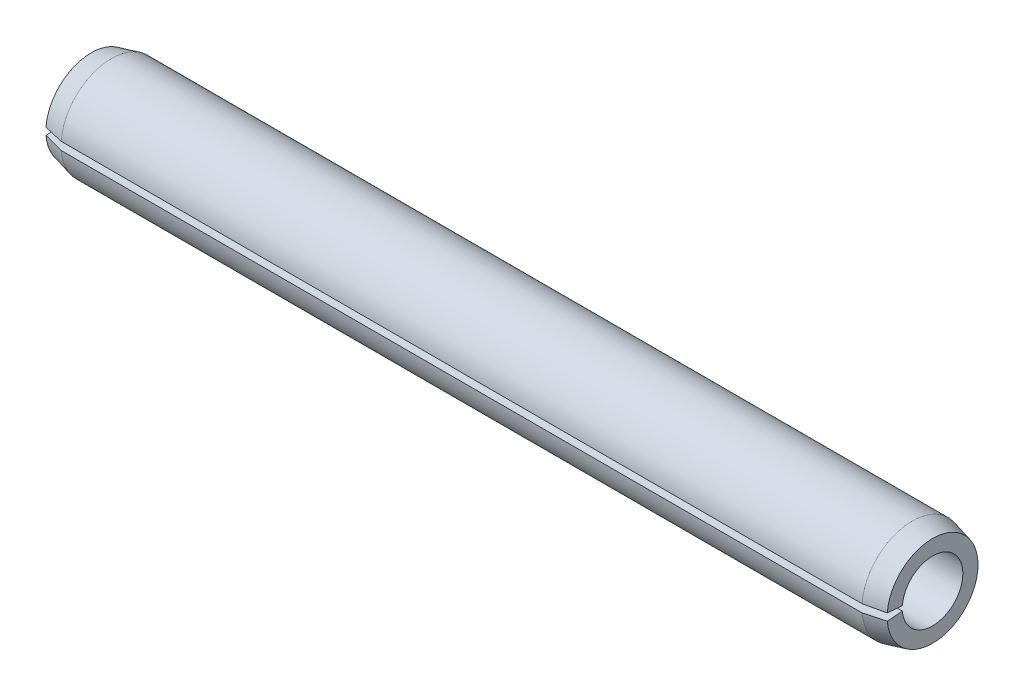
ISO-10303-21;
HEADER;
FILE_DESCRIPTION(('STEP AP214'),'2;1');
FILE_NAME('part.step','',(''),(''),'','','');
FILE_SCHEMA(('AUTOMOTIVE_DESIGN { 1 0 10303 214 1 1 1 1 }'));
ENDSEC;
DATA;
#1=APPLICATION_CONTEXT('core data for automotive mechanical design processes');
#2=APPLICATION_PROTOCOL_DEFINITION('international standard','automotive_design',2000,#1);
#3=PRODUCT_CONTEXT('',#1,'mechanical');
#4=PRODUCT('Part','Part','',(#3));
#5=PRODUCT_RELATED_PRODUCT_CATEGORY('part','',(#4));
#6=PRODUCT_DEFINITION_FORMATION('','',#4);
#7=PRODUCT_DEFINITION_CONTEXT('part definition',#1,'design');
#8=PRODUCT_DEFINITION('design','',#6,#7);
#9=PRODUCT_DEFINITION_SHAPE('','',#8);
#10=(LENGTH_UNIT() NAMED_UNIT(*) SI_UNIT(.MILLI.,.METRE.));
#11=(NAMED_UNIT(*) PLANE_ANGLE_UNIT() SI_UNIT($,.RADIAN.));
#12=(NAMED_UNIT(*) SI_UNIT($,.STERADIAN.) SOLID_ANGLE_UNIT());
#13=UNCERTAINTY_MEASURE_WITH_UNIT(LENGTH_MEASURE(1.E-05),#10,'distance_accuracy_value','');
#14=(GEOMETRIC_REPRESENTATION_CONTEXT(3) GLOBAL_UNCERTAINTY_ASSIGNED_CONTEXT((#13)) GLOBAL_UNIT_ASSIGNED_CONTEXT((#10,
#11,#12)) REPRESENTATION_CONTEXT('',''));
#15=CARTESIAN_POINT('',(0.,0.,0.));
#16=DIRECTION('',(0.,0.,1.));
#17=DIRECTION('',(1.,0.,0.));
#18=AXIS2_PLACEMENT_3D('',#15,#16,#17);
#19=CARTESIAN_POINT('',(50.,-2.7324,-2.732350061));
#20=DIRECTION('',(-1.,0.,0.));
#21=DIRECTION('',(0.,0.,1.));
#22=AXIS2_PLACEMENT_3D('',#19,#20,#21);
#23=PLANE('',#22);
#24=CARTESIAN_POINT('',(50.,0.,0.));
#25=DIRECTION('',(-1.,0.,0.));
#26=DIRECTION('',(0.,0.,1.));
#27=AXIS2_PLACEMENT_3D('',#24,#25,#26);
#28=CIRCLE('',#27,1.8);
#29=CARTESIAN_POINT('',(50.,-0.141226372001351,1.79445120074393));
#30=VERTEX_POINT('',#29);
#31=CARTESIAN_POINT('',(50.,0.141226371840222,1.79445120075661));
#32=VERTEX_POINT('',#31);
#33=EDGE_CURVE('E81',#30,#32,#28,.F.);
#34=ORIENTED_EDGE('',*,*,#33,.F.);
#35=DIRECTION('',(0.,-0.0784590958639548,0.996917333722416));
#36=VECTOR('',#35,1.);
#37=CARTESIAN_POINT('',(50.,-0.1883018295,2.392601601));
#38=LINE('',#37,#36);
#39=CARTESIAN_POINT('',(50.,-0.211839558145811,2.69167680110457));
#40=VERTEX_POINT('',#39);
#41=EDGE_CURVE('E102',#30,#40,#38,.T.);
#42=ORIENTED_EDGE('',*,*,#41,.T.);
#43=CARTESIAN_POINT('',(50.,0.,0.));
#44=DIRECTION('',(-1.,0.,0.));
#45=DIRECTION('',(0.,0.,1.));
#46=AXIS2_PLACEMENT_3D('',#43,#44,#45);
#47=CIRCLE('',#46,2.69999999999999);
#48=CARTESIAN_POINT('',(50.,0.211839558253768,2.69167680104788));
#49=VERTEX_POINT('',#48);
#50=EDGE_CURVE('E106',#40,#49,#47,.F.);
#51=ORIENTED_EDGE('',*,*,#50,.T.);
#52=DIRECTION('',(0.,0.0784590958639548,0.996917333722416));
#53=VECTOR('',#52,1.);
#54=CARTESIAN_POINT('',(50.,0.1883018295,2.392601601));
#55=LINE('',#54,#53);
#56=EDGE_CURVE('E104',#32,#49,#55,.T.);
#57=ORIENTED_EDGE('',*,*,#56,.F.);
#58=EDGE_LOOP('',(#34,#42,#51,#57));
#59=FACE_BOUND('',#58,.T.);
#60=ADVANCED_FACE('F17',(#59),#23,.F.);
#61=CARTESIAN_POINT('',(0.,-0.235377287,2.990752001));
#62=DIRECTION('',(0.,-0.996917333722416,-0.0784590958639548));
#63=DIRECTION('',(0.,0.0784590958639548,-0.996917333722416));
#64=AXIS2_PLACEMENT_3D('',#61,#62,#63);
#65=PLANE('',#64);
#66=DIRECTION('',(0.970142500145332,-0.0190291258060693,0.241787968647783));
#67=VECTOR('',#66,1.);
#68=CARTESIAN_POINT('',(0.,-0.211839558286294,2.69167680109352));
#69=LINE('',#68,#67);
#70=CARTESIAN_POINT('',(1.19999999999998,-0.235377286844655,2.99075200122605));
#71=VERTEX_POINT('',#70);
#72=CARTESIAN_POINT('',(0.,-0.211839558271916,2.69167680109466));
#73=VERTEX_POINT('',#72);
#74=EDGE_CURVE('E21',#71,#73,#69,.F.);
#75=ORIENTED_EDGE('',*,*,#74,.F.);
#76=DIRECTION('',(-1.,0.,0.));
#77=VECTOR('',#76,1.);
#78=CARTESIAN_POINT('',(25.,-0.235377286704538,2.99075200123708));
#79=LINE('',#78,#77);
#80=CARTESIAN_POINT('',(48.8000000000251,-0.235377286704047,2.99075200123083));
#81=VERTEX_POINT('',#80);
#82=EDGE_CURVE('E72',#71,#81,#79,.F.);
#83=ORIENTED_EDGE('',*,*,#82,.T.);
#84=DIRECTION('',(-0.970142500145332,-0.0190291257834137,0.241787968649565));
#85=VECTOR('',#84,1.);
#86=CARTESIAN_POINT('',(49.4,-0.223608422369311,2.84121440117523));
#87=LINE('',#86,#85);
#88=EDGE_CURVE('E101',#81,#40,#87,.F.);
#89=ORIENTED_EDGE('',*,*,#88,.T.);
#90=ORIENTED_EDGE('',*,*,#41,.F.);
#91=DIRECTION('',(-1.,0.,0.));
#92=VECTOR('',#91,1.);
#93=CARTESIAN_POINT('',(25.,-0.141226372022723,1.79445120074225));
#94=LINE('',#93,#92);
#95=CARTESIAN_POINT('',(0.,-0.141226372001351,1.79445120074393));
#96=VERTEX_POINT('',#95);
#97=EDGE_CURVE('E118',#96,#30,#94,.F.);
#98=ORIENTED_EDGE('',*,*,#97,.F.);
#99=DIRECTION('',(0.,0.0784590958639548,-0.996917333722416));
#100=VECTOR('',#99,1.);
#101=CARTESIAN_POINT('',(0.,-0.1883018295,2.392601601));
#102=LINE('',#101,#100);
#103=EDGE_CURVE('E99',#73,#96,#102,.T.);
#104=ORIENTED_EDGE('',*,*,#103,.F.);
#105=EDGE_LOOP('',(#75,#83,#89,#90,#98,#104));
#106=FACE_BOUND('',#105,.T.);
#107=ADVANCED_FACE('F138',(#106),#65,.F.);
#108=CARTESIAN_POINT('',(50.,0.,0.));
#109=DIRECTION('',(-1.,0.,0.));
#110=DIRECTION('',(0.,0.,1.));
#111=AXIS2_PLACEMENT_3D('',#108,#109,#110);
#112=CONICAL_SURFACE('',#111,2.7,0.244978663126863);
#113=ORIENTED_EDGE('',*,*,#50,.F.);
#114=ORIENTED_EDGE('',*,*,#88,.F.);
#115=CARTESIAN_POINT('',(48.8,0.,0.));
#116=DIRECTION('',(-1.,0.,0.));
#117=DIRECTION('',(0.,0.,1.));
#118=AXIS2_PLACEMENT_3D('',#115,#116,#117);
#119=CIRCLE('',#118,3.);
#120=CARTESIAN_POINT('',(48.7999999995736,0.235377286796042,2.99075200112297));
#121=VERTEX_POINT('',#120);
#122=EDGE_CURVE('E88',#81,#121,#119,.F.);
#123=ORIENTED_EDGE('',*,*,#122,.T.);
#124=DIRECTION('',(-0.970142500167604,0.0190291258481599,0.241787968555105));
#125=VECTOR('',#124,1.);
#126=CARTESIAN_POINT('',(50.,0.21183955825,2.691676801));
#127=LINE('',#126,#125);
#128=EDGE_CURVE('E87',#49,#121,#127,.T.);
#129=ORIENTED_EDGE('',*,*,#128,.F.);
#130=EDGE_LOOP('',(#113,#114,#123,#129));
#131=FACE_BOUND('',#130,.T.);
#132=ADVANCED_FACE('F125',(#131),#112,.T.);
#133=CARTESIAN_POINT('',(0.,0.235377287,2.990752001));
#134=DIRECTION('',(0.,-0.996917333722416,0.0784590958639548));
#135=DIRECTION('',(0.,-0.0784590958639548,-0.996917333722416));
#136=AXIS2_PLACEMENT_3D('',#133,#134,#135);
#137=PLANE('',#136);
#138=DIRECTION('',(0.970142500145332,0.0190291258825971,0.24178796864176));
#139=VECTOR('',#138,1.);
#140=CARTESIAN_POINT('',(0.6,0.2236084235348,2.8412144010835));
#141=LINE('',#140,#139);
#142=CARTESIAN_POINT('',(1.19999999999999,0.235377287596547,2.99075200116688));
#143=VERTEX_POINT('',#142);
#144=CARTESIAN_POINT('',(0.,0.211839558697885,2.69167680106113));
#145=VERTEX_POINT('',#144);
#146=EDGE_CURVE('E77',#143,#145,#141,.F.);
#147=ORIENTED_EDGE('',*,*,#146,.T.);
#148=DIRECTION('',(0.,-0.0784590958639548,-0.996917333722416));
#149=VECTOR('',#148,1.);
#150=CARTESIAN_POINT('',(0.,0.1883018295,2.392601601));
#151=LINE('',#150,#149);
#152=CARTESIAN_POINT('',(0.,0.141226371840222,1.79445120075661));
#153=VERTEX_POINT('',#152);
#154=EDGE_CURVE('E95',#145,#153,#151,.T.);
#155=ORIENTED_EDGE('',*,*,#154,.T.);
#156=DIRECTION('',(1.,0.,0.));
#157=VECTOR('',#156,1.);
#158=CARTESIAN_POINT('',(25.,0.141226371700465,1.79445120076761));
#159=LINE('',#158,#157);
#160=EDGE_CURVE('E127',#32,#153,#159,.F.);
#161=ORIENTED_EDGE('',*,*,#160,.F.);
#162=ORIENTED_EDGE('',*,*,#56,.T.);
#163=ORIENTED_EDGE('',*,*,#128,.T.);
#164=DIRECTION('',(1.,0.,0.));
#165=VECTOR('',#164,1.);
#166=CARTESIAN_POINT('',(25.,0.235377286167442,2.99075200127935));
#167=LINE('',#166,#165);
#168=EDGE_CURVE('E71',#121,#143,#167,.F.);
#169=ORIENTED_EDGE('',*,*,#168,.T.);
#170=EDGE_LOOP('',(#147,#155,#161,#162,#163,#169));
#171=FACE_BOUND('',#170,.T.);
#172=ADVANCED_FACE('F84',(#171),#137,.T.);
#173=CARTESIAN_POINT('',(50.,0.,0.));
#174=DIRECTION('',(-1.,0.,0.));
#175=DIRECTION('',(0.,0.,1.));
#176=AXIS2_PLACEMENT_3D('',#173,#174,#175);
#177=CYLINDRICAL_SURFACE('',#176,1.8);
#178=ORIENTED_EDGE('',*,*,#97,.T.);
#179=ORIENTED_EDGE('',*,*,#33,.T.);
#180=ORIENTED_EDGE('',*,*,#160,.T.);
#181=CARTESIAN_POINT('',(0.,0.,0.));
#182=DIRECTION('',(-1.,0.,0.));
#183=DIRECTION('',(0.,0.,1.));
#184=AXIS2_PLACEMENT_3D('',#181,#182,#183);
#185=CIRCLE('',#184,1.8);
#186=EDGE_CURVE('E74',#153,#96,#185,.T.);
#187=ORIENTED_EDGE('',*,*,#186,.T.);
#188=EDGE_LOOP('',(#178,#179,#180,#187));
#189=FACE_BOUND('',#188,.T.);
#190=ADVANCED_FACE('F132',(#189),#177,.F.);
#191=CARTESIAN_POINT('',(48.8,0.,0.));
#192=DIRECTION('',(-1.,0.,0.));
#193=DIRECTION('',(0.,0.,1.));
#194=AXIS2_PLACEMENT_3D('',#191,#192,#193);
#195=CYLINDRICAL_SURFACE('',#194,3.);
#196=ORIENTED_EDGE('',*,*,#122,.F.);
#197=ORIENTED_EDGE('',*,*,#82,.F.);
#198=CARTESIAN_POINT('',(1.19999999999998,0.,0.));
#199=DIRECTION('',(1.,0.,0.));
#200=DIRECTION('',(0.,0.,-1.));
#201=AXIS2_PLACEMENT_3D('',#198,#199,#200);
#202=CIRCLE('',#201,3.);
#203=EDGE_CURVE('E27',#71,#143,#202,.T.);
#204=ORIENTED_EDGE('',*,*,#203,.T.);
#205=ORIENTED_EDGE('',*,*,#168,.F.);
#206=EDGE_LOOP('',(#196,#197,#204,#205));
#207=FACE_BOUND('',#206,.T.);
#208=ADVANCED_FACE('F69',(#207),#195,.T.);
#209=CARTESIAN_POINT('',(0.,-2.7324,2.724026862));
#210=DIRECTION('',(1.,0.,0.));
#211=DIRECTION('',(0.,0.,-1.));
#212=AXIS2_PLACEMENT_3D('',#209,#210,#211);
#213=PLANE('',#212);
#214=ORIENTED_EDGE('',*,*,#154,.F.);
#215=CARTESIAN_POINT('',(0.,0.,0.));
#216=DIRECTION('',(1.,0.,0.));
#217=DIRECTION('',(0.,0.,-1.));
#218=AXIS2_PLACEMENT_3D('',#215,#216,#217);
#219=CIRCLE('',#218,2.7);
#220=EDGE_CURVE('E11',#145,#73,#219,.F.);
#221=ORIENTED_EDGE('',*,*,#220,.T.);
#222=ORIENTED_EDGE('',*,*,#103,.T.);
#223=ORIENTED_EDGE('',*,*,#186,.F.);
#224=EDGE_LOOP('',(#214,#221,#222,#223));
#225=FACE_BOUND('',#224,.T.);
#226=ADVANCED_FACE('F19',(#225),#213,.F.);
#227=CARTESIAN_POINT('',(0.,0.,0.));
#228=DIRECTION('',(1.,0.,0.));
#229=DIRECTION('',(0.,0.,-1.));
#230=AXIS2_PLACEMENT_3D('',#227,#228,#229);
#231=CONICAL_SURFACE('',#230,2.7,0.244978663126864);
#232=ORIENTED_EDGE('',*,*,#220,.F.);
#233=ORIENTED_EDGE('',*,*,#146,.F.);
#234=ORIENTED_EDGE('',*,*,#203,.F.);
#235=ORIENTED_EDGE('',*,*,#74,.T.);
#236=EDGE_LOOP('',(#232,#233,#234,#235));
#237=FACE_BOUND('',#236,.T.);
#238=ADVANCED_FACE('F78',(#237),#231,.T.);
#239=CLOSED_SHELL('',(#60,#107,#132,#172,#190,#208,#226,#238));
#240=MANIFOLD_SOLID_BREP('B1',#239);
#241=ADVANCED_BREP_SHAPE_REPRESENTATION('',(#18,#240),#14);
#242=SHAPE_DEFINITION_REPRESENTATION(#9,#241);
ENDSEC;
END-ISO-10303-21;
